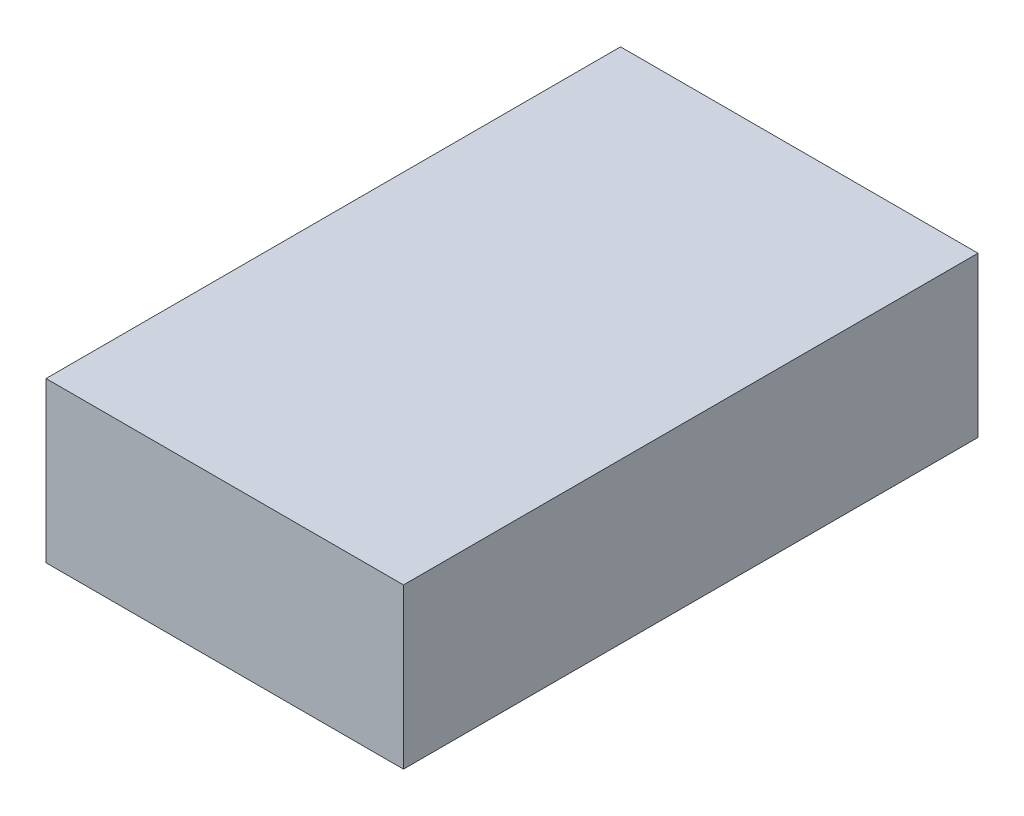
ISO-10303-21;
HEADER;
FILE_DESCRIPTION(('STEP AP214'),'2;1');
FILE_NAME('part.step','',(''),(''),'','','');
FILE_SCHEMA(('AUTOMOTIVE_DESIGN { 1 0 10303 214 1 1 1 1 }'));
ENDSEC;
DATA;
#1=APPLICATION_CONTEXT('core data for automotive mechanical design processes');
#2=APPLICATION_PROTOCOL_DEFINITION('international standard','automotive_design',2000,#1);
#3=PRODUCT_CONTEXT('',#1,'mechanical');
#4=PRODUCT('Part','Part','',(#3));
#5=PRODUCT_RELATED_PRODUCT_CATEGORY('part','',(#4));
#6=PRODUCT_DEFINITION_FORMATION('','',#4);
#7=PRODUCT_DEFINITION_CONTEXT('part definition',#1,'design');
#8=PRODUCT_DEFINITION('design','',#6,#7);
#9=PRODUCT_DEFINITION_SHAPE('','',#8);
#10=(LENGTH_UNIT() NAMED_UNIT(*) SI_UNIT(.MILLI.,.METRE.));
#11=(NAMED_UNIT(*) PLANE_ANGLE_UNIT() SI_UNIT($,.RADIAN.));
#12=(NAMED_UNIT(*) SI_UNIT($,.STERADIAN.) SOLID_ANGLE_UNIT());
#13=UNCERTAINTY_MEASURE_WITH_UNIT(LENGTH_MEASURE(1.E-05),#10,'distance_accuracy_value','');
#14=(GEOMETRIC_REPRESENTATION_CONTEXT(3) GLOBAL_UNCERTAINTY_ASSIGNED_CONTEXT((#13)) GLOBAL_UNIT_ASSIGNED_CONTEXT((#10,
#11,#12)) REPRESENTATION_CONTEXT('',''));
#15=CARTESIAN_POINT('',(0.,0.,0.));
#16=DIRECTION('',(0.,0.,1.));
#17=DIRECTION('',(1.,0.,0.));
#18=AXIS2_PLACEMENT_3D('',#15,#16,#17);
#19=CARTESIAN_POINT('',(0.,0.,114.3));
#20=DIRECTION('',(1.,0.,0.));
#21=DIRECTION('',(0.,0.,-1.));
#22=AXIS2_PLACEMENT_3D('',#19,#20,#21);
#23=PLANE('',#22);
#24=DIRECTION('',(0.,-1.,0.));
#25=VECTOR('',#24,1.);
#26=CARTESIAN_POINT('',(0.,0.,0.));
#27=LINE('',#26,#25);
#28=CARTESIAN_POINT('',(0.,31.75,0.));
#29=VERTEX_POINT('',#28);
#30=CARTESIAN_POINT('',(0.,0.,0.));
#31=VERTEX_POINT('',#30);
#32=EDGE_CURVE('E104',#29,#31,#27,.T.);
#33=ORIENTED_EDGE('',*,*,#32,.T.);
#34=DIRECTION('',(0.,0.,-1.));
#35=VECTOR('',#34,1.);
#36=CARTESIAN_POINT('',(0.,0.,114.3));
#37=LINE('',#36,#35);
#38=CARTESIAN_POINT('',(0.,0.,114.3));
#39=VERTEX_POINT('',#38);
#40=EDGE_CURVE('E11',#39,#31,#37,.T.);
#41=ORIENTED_EDGE('',*,*,#40,.F.);
#42=DIRECTION('',(0.,-1.,0.));
#43=VECTOR('',#42,1.);
#44=CARTESIAN_POINT('',(0.,0.,114.3));
#45=LINE('',#44,#43);
#46=CARTESIAN_POINT('',(0.,31.75,114.3));
#47=VERTEX_POINT('',#46);
#48=EDGE_CURVE('E92',#47,#39,#45,.T.);
#49=ORIENTED_EDGE('',*,*,#48,.F.);
#50=DIRECTION('',(0.,0.,-1.));
#51=VECTOR('',#50,1.);
#52=CARTESIAN_POINT('',(0.,31.75,114.3));
#53=LINE('',#52,#51);
#54=EDGE_CURVE('E100',#47,#29,#53,.T.);
#55=ORIENTED_EDGE('',*,*,#54,.T.);
#56=EDGE_LOOP('',(#33,#41,#49,#55));
#57=FACE_BOUND('',#56,.T.);
#58=ADVANCED_FACE('F41',(#57),#23,.F.);
#59=CARTESIAN_POINT('',(0.,0.,114.3));
#60=DIRECTION('',(0.,1.,0.));
#61=DIRECTION('',(0.,0.,1.));
#62=AXIS2_PLACEMENT_3D('',#59,#60,#61);
#63=PLANE('',#62);
#64=DIRECTION('',(1.,0.,0.));
#65=VECTOR('',#64,1.);
#66=CARTESIAN_POINT('',(0.,0.,0.));
#67=LINE('',#66,#65);
#68=CARTESIAN_POINT('',(71.12,0.,0.));
#69=VERTEX_POINT('',#68);
#70=EDGE_CURVE('E96',#31,#69,#67,.T.);
#71=ORIENTED_EDGE('',*,*,#70,.T.);
#72=DIRECTION('',(0.,0.,-1.));
#73=VECTOR('',#72,1.);
#74=CARTESIAN_POINT('',(71.12,0.,114.3));
#75=LINE('',#74,#73);
#76=CARTESIAN_POINT('',(71.12,0.,114.3));
#77=VERTEX_POINT('',#76);
#78=EDGE_CURVE('E49',#77,#69,#75,.T.);
#79=ORIENTED_EDGE('',*,*,#78,.F.);
#80=DIRECTION('',(1.,0.,0.));
#81=VECTOR('',#80,1.);
#82=CARTESIAN_POINT('',(0.,0.,114.3));
#83=LINE('',#82,#81);
#84=EDGE_CURVE('E87',#39,#77,#83,.T.);
#85=ORIENTED_EDGE('',*,*,#84,.F.);
#86=ORIENTED_EDGE('',*,*,#40,.T.);
#87=EDGE_LOOP('',(#71,#79,#85,#86));
#88=FACE_BOUND('',#87,.T.);
#89=ADVANCED_FACE('F95',(#88),#63,.F.);
#90=CARTESIAN_POINT('',(71.12,0.,114.3));
#91=DIRECTION('',(-1.,0.,0.));
#92=DIRECTION('',(0.,0.,1.));
#93=AXIS2_PLACEMENT_3D('',#90,#91,#92);
#94=PLANE('',#93);
#95=DIRECTION('',(0.,1.,0.));
#96=VECTOR('',#95,1.);
#97=CARTESIAN_POINT('',(71.12,0.,0.));
#98=LINE('',#97,#96);
#99=CARTESIAN_POINT('',(71.12,31.75,0.));
#100=VERTEX_POINT('',#99);
#101=EDGE_CURVE('E74',#69,#100,#98,.T.);
#102=ORIENTED_EDGE('',*,*,#101,.T.);
#103=DIRECTION('',(0.,0.,-1.));
#104=VECTOR('',#103,1.);
#105=CARTESIAN_POINT('',(71.12,31.75,114.3));
#106=LINE('',#105,#104);
#107=CARTESIAN_POINT('',(71.12,31.75,114.3));
#108=VERTEX_POINT('',#107);
#109=EDGE_CURVE('E97',#108,#100,#106,.T.);
#110=ORIENTED_EDGE('',*,*,#109,.F.);
#111=DIRECTION('',(0.,1.,0.));
#112=VECTOR('',#111,1.);
#113=CARTESIAN_POINT('',(71.12,0.,114.3));
#114=LINE('',#113,#112);
#115=EDGE_CURVE('E90',#77,#108,#114,.T.);
#116=ORIENTED_EDGE('',*,*,#115,.F.);
#117=ORIENTED_EDGE('',*,*,#78,.T.);
#118=EDGE_LOOP('',(#102,#110,#116,#117));
#119=FACE_BOUND('',#118,.T.);
#120=ADVANCED_FACE('F98',(#119),#94,.F.);
#121=CARTESIAN_POINT('',(0.,31.75,114.3));
#122=DIRECTION('',(0.,-1.,0.));
#123=DIRECTION('',(0.,0.,-1.));
#124=AXIS2_PLACEMENT_3D('',#121,#122,#123);
#125=PLANE('',#124);
#126=DIRECTION('',(-1.,0.,0.));
#127=VECTOR('',#126,1.);
#128=CARTESIAN_POINT('',(0.,31.75,0.));
#129=LINE('',#128,#127);
#130=EDGE_CURVE('E80',#100,#29,#129,.T.);
#131=ORIENTED_EDGE('',*,*,#130,.T.);
#132=ORIENTED_EDGE('',*,*,#54,.F.);
#133=DIRECTION('',(-1.,0.,0.));
#134=VECTOR('',#133,1.);
#135=CARTESIAN_POINT('',(0.,31.75,114.3));
#136=LINE('',#135,#134);
#137=EDGE_CURVE('E57',#108,#47,#136,.T.);
#138=ORIENTED_EDGE('',*,*,#137,.F.);
#139=ORIENTED_EDGE('',*,*,#109,.T.);
#140=EDGE_LOOP('',(#131,#132,#138,#139));
#141=FACE_BOUND('',#140,.T.);
#142=ADVANCED_FACE('F111',(#141),#125,.F.);
#143=CARTESIAN_POINT('',(0.,0.,114.3));
#144=DIRECTION('',(0.,0.,-1.));
#145=DIRECTION('',(-1.,0.,0.));
#146=AXIS2_PLACEMENT_3D('',#143,#144,#145);
#147=PLANE('',#146);
#148=ORIENTED_EDGE('',*,*,#48,.T.);
#149=ORIENTED_EDGE('',*,*,#84,.T.);
#150=ORIENTED_EDGE('',*,*,#115,.T.);
#151=ORIENTED_EDGE('',*,*,#137,.T.);
#152=EDGE_LOOP('',(#148,#149,#150,#151));
#153=FACE_BOUND('',#152,.T.);
#154=ADVANCED_FACE('F88',(#153),#147,.F.);
#155=CARTESIAN_POINT('',(0.,0.,0.));
#156=DIRECTION('',(0.,0.,-1.));
#157=DIRECTION('',(-1.,0.,0.));
#158=AXIS2_PLACEMENT_3D('',#155,#156,#157);
#159=PLANE('',#158);
#160=ORIENTED_EDGE('',*,*,#32,.F.);
#161=ORIENTED_EDGE('',*,*,#130,.F.);
#162=ORIENTED_EDGE('',*,*,#101,.F.);
#163=ORIENTED_EDGE('',*,*,#70,.F.);
#164=EDGE_LOOP('',(#160,#161,#162,#163));
#165=FACE_BOUND('',#164,.T.);
#166=ADVANCED_FACE('F114',(#165),#159,.T.);
#167=CLOSED_SHELL('',(#58,#89,#120,#142,#154,#166));
#168=MANIFOLD_SOLID_BREP('B2',#167);
#169=ADVANCED_BREP_SHAPE_REPRESENTATION('',(#18,#168),#14);
#170=SHAPE_DEFINITION_REPRESENTATION(#9,#169);
ENDSEC;
END-ISO-10303-21;
